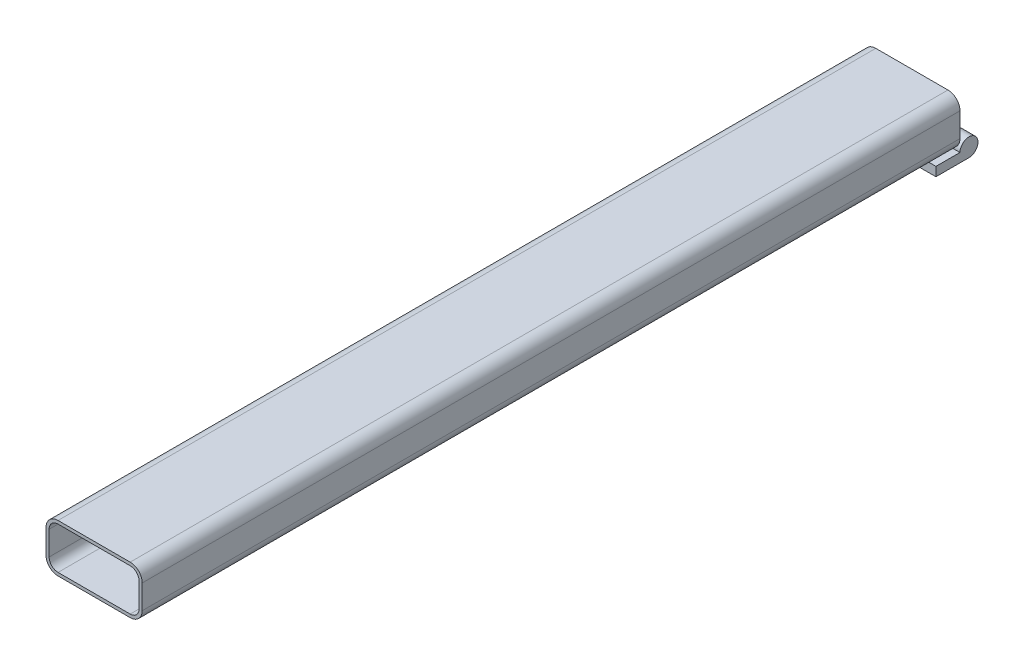
ISO-10303-21;
HEADER;
FILE_DESCRIPTION(('STEP AP214'),'2;1');
FILE_NAME('part.step','',(''),(''),'','','');
FILE_SCHEMA(('AUTOMOTIVE_DESIGN { 1 0 10303 214 1 1 1 1 }'));
ENDSEC;
DATA;
#1=APPLICATION_CONTEXT('core data for automotive mechanical design processes');
#2=APPLICATION_PROTOCOL_DEFINITION('international standard','automotive_design',2000,#1);
#3=PRODUCT_CONTEXT('',#1,'mechanical');
#4=PRODUCT('Part','Part','',(#3));
#5=PRODUCT_RELATED_PRODUCT_CATEGORY('part','',(#4));
#6=PRODUCT_DEFINITION_FORMATION('','',#4);
#7=PRODUCT_DEFINITION_CONTEXT('part definition',#1,'design');
#8=PRODUCT_DEFINITION('design','',#6,#7);
#9=PRODUCT_DEFINITION_SHAPE('','',#8);
#10=(LENGTH_UNIT() NAMED_UNIT(*) SI_UNIT(.MILLI.,.METRE.));
#11=(NAMED_UNIT(*) PLANE_ANGLE_UNIT() SI_UNIT($,.RADIAN.));
#12=(NAMED_UNIT(*) SI_UNIT($,.STERADIAN.) SOLID_ANGLE_UNIT());
#13=UNCERTAINTY_MEASURE_WITH_UNIT(LENGTH_MEASURE(1.E-05),#10,'distance_accuracy_value','');
#14=(GEOMETRIC_REPRESENTATION_CONTEXT(3) GLOBAL_UNCERTAINTY_ASSIGNED_CONTEXT((#13)) GLOBAL_UNIT_ASSIGNED_CONTEXT((#10,
#11,#12)) REPRESENTATION_CONTEXT('',''));
#15=CARTESIAN_POINT('',(0.,0.,0.));
#16=DIRECTION('',(0.,0.,1.));
#17=DIRECTION('',(1.,0.,0.));
#18=AXIS2_PLACEMENT_3D('',#15,#16,#17);
#19=CARTESIAN_POINT('',(-25.4,-12.7,-220.6625));
#20=DIRECTION('',(1.,0.,0.));
#21=DIRECTION('',(0.,0.,-1.));
#22=AXIS2_PLACEMENT_3D('',#19,#20,#21);
#23=CYLINDRICAL_SURFACE('',#22,4.7625);
#24=CARTESIAN_POINT('',(-9.525,-12.7,-220.6625));
#25=DIRECTION('',(-1.,0.,0.));
#26=DIRECTION('',(0.,0.,1.));
#27=AXIS2_PLACEMENT_3D('',#24,#25,#26);
#28=CIRCLE('',#27,4.7625);
#29=CARTESIAN_POINT('',(-9.52499999999999,-17.4625000000001,-220.6625));
#30=VERTEX_POINT('',#29);
#31=CARTESIAN_POINT('',(-9.525,-12.7,-215.9));
#32=VERTEX_POINT('',#31);
#33=EDGE_CURVE('E218',#30,#32,#28,.F.);
#34=ORIENTED_EDGE('',*,*,#33,.F.);
#35=DIRECTION('',(1.,0.,0.));
#36=VECTOR('',#35,1.);
#37=CARTESIAN_POINT('',(-25.4,-17.4625,-220.6625));
#38=LINE('',#37,#36);
#39=CARTESIAN_POINT('',(-25.4,-17.4625,-220.6625));
#40=VERTEX_POINT('',#39);
#41=EDGE_CURVE('E250',#40,#30,#38,.T.);
#42=ORIENTED_EDGE('',*,*,#41,.F.);
#43=CARTESIAN_POINT('',(-25.4,-12.7,-220.6625));
#44=DIRECTION('',(1.,0.,0.));
#45=DIRECTION('',(0.,0.,-1.));
#46=AXIS2_PLACEMENT_3D('',#43,#44,#45);
#47=CIRCLE('',#46,4.7625);
#48=CARTESIAN_POINT('',(-25.4,-12.7,-215.9));
#49=VERTEX_POINT('',#48);
#50=EDGE_CURVE('E231',#40,#49,#47,.T.);
#51=ORIENTED_EDGE('',*,*,#50,.T.);
#52=DIRECTION('',(1.,0.,0.));
#53=VECTOR('',#52,1.);
#54=CARTESIAN_POINT('',(-25.4,-12.7,-215.9));
#55=LINE('',#54,#53);
#56=CARTESIAN_POINT('',(-19.05,-12.7,-215.9));
#57=VERTEX_POINT('',#56);
#58=EDGE_CURVE('E245',#49,#57,#55,.T.);
#59=ORIENTED_EDGE('',*,*,#58,.T.);
#60=DIRECTION('',(1.,0.,0.));
#61=VECTOR('',#60,1.);
#62=CARTESIAN_POINT('',(-19.05,-12.7,-215.9));
#63=LINE('',#62,#61);
#64=EDGE_CURVE('E338',#57,#32,#63,.T.);
#65=ORIENTED_EDGE('',*,*,#64,.T.);
#66=EDGE_LOOP('',(#34,#42,#51,#59,#65));
#67=FACE_BOUND('',#66,.T.);
#68=ADVANCED_FACE('F32',(#67),#23,.T.);
#69=CARTESIAN_POINT('',(-19.05,-6.35,215.9));
#70=DIRECTION('',(0.,0.,-1.));
#71=DIRECTION('',(-1.,0.,0.));
#72=AXIS2_PLACEMENT_3D('',#69,#70,#71);
#73=PLANE('',#72);
#74=CARTESIAN_POINT('',(-19.05,-6.35,215.9));
#75=DIRECTION('',(0.,0.,1.));
#76=DIRECTION('',(-1.,0.,0.));
#77=AXIS2_PLACEMENT_3D('',#74,#75,#76);
#78=CIRCLE('',#77,6.35);
#79=CARTESIAN_POINT('',(-25.4,-6.35,215.9));
#80=VERTEX_POINT('',#79);
#81=CARTESIAN_POINT('',(-19.05,-12.7,215.9));
#82=VERTEX_POINT('',#81);
#83=EDGE_CURVE('E317',#80,#82,#78,.T.);
#84=ORIENTED_EDGE('',*,*,#83,.T.);
#85=DIRECTION('',(1.,0.,0.));
#86=VECTOR('',#85,1.);
#87=CARTESIAN_POINT('',(-19.05,-12.7,215.9));
#88=LINE('',#87,#86);
#89=CARTESIAN_POINT('',(19.05,-12.7,215.9));
#90=VERTEX_POINT('',#89);
#91=EDGE_CURVE('E320',#82,#90,#88,.T.);
#92=ORIENTED_EDGE('',*,*,#91,.T.);
#93=CARTESIAN_POINT('',(19.05,-6.35,215.9));
#94=DIRECTION('',(0.,0.,1.));
#95=DIRECTION('',(1.,0.,0.));
#96=AXIS2_PLACEMENT_3D('',#93,#94,#95);
#97=CIRCLE('',#96,6.35);
#98=CARTESIAN_POINT('',(25.4,-6.35,215.9));
#99=VERTEX_POINT('',#98);
#100=EDGE_CURVE('E323',#90,#99,#97,.T.);
#101=ORIENTED_EDGE('',*,*,#100,.T.);
#102=DIRECTION('',(0.,1.,0.));
#103=VECTOR('',#102,1.);
#104=CARTESIAN_POINT('',(25.4,-6.35,215.9));
#105=LINE('',#104,#103);
#106=CARTESIAN_POINT('',(25.4,6.35,215.9));
#107=VERTEX_POINT('',#106);
#108=EDGE_CURVE('E325',#99,#107,#105,.T.);
#109=ORIENTED_EDGE('',*,*,#108,.T.);
#110=CARTESIAN_POINT('',(19.05,6.35,215.9));
#111=DIRECTION('',(0.,0.,1.));
#112=DIRECTION('',(-1.,0.,0.));
#113=AXIS2_PLACEMENT_3D('',#110,#111,#112);
#114=CIRCLE('',#113,6.35);
#115=CARTESIAN_POINT('',(19.05,12.7,215.9));
#116=VERTEX_POINT('',#115);
#117=EDGE_CURVE('E327',#107,#116,#114,.T.);
#118=ORIENTED_EDGE('',*,*,#117,.T.);
#119=DIRECTION('',(-1.,0.,0.));
#120=VECTOR('',#119,1.);
#121=CARTESIAN_POINT('',(-19.05,12.7,215.9));
#122=LINE('',#121,#120);
#123=CARTESIAN_POINT('',(-19.05,12.7,215.9));
#124=VERTEX_POINT('',#123);
#125=EDGE_CURVE('E329',#116,#124,#122,.T.);
#126=ORIENTED_EDGE('',*,*,#125,.T.);
#127=CARTESIAN_POINT('',(-19.05,6.35,215.9));
#128=DIRECTION('',(0.,0.,1.));
#129=DIRECTION('',(-1.,0.,0.));
#130=AXIS2_PLACEMENT_3D('',#127,#128,#129);
#131=CIRCLE('',#130,6.35);
#132=CARTESIAN_POINT('',(-25.4,6.35,215.9));
#133=VERTEX_POINT('',#132);
#134=EDGE_CURVE('E331',#124,#133,#131,.T.);
#135=ORIENTED_EDGE('',*,*,#134,.T.);
#136=DIRECTION('',(0.,-1.,0.));
#137=VECTOR('',#136,1.);
#138=CARTESIAN_POINT('',(-25.4,-6.35,215.9));
#139=LINE('',#138,#137);
#140=EDGE_CURVE('E333',#133,#80,#139,.T.);
#141=ORIENTED_EDGE('',*,*,#140,.T.);
#142=EDGE_LOOP('',(#84,#92,#101,#109,#118,#126,#135,#141));
#143=FACE_BOUND('',#142,.T.);
#144=CARTESIAN_POINT('',(-19.05,6.35,215.9));
#145=DIRECTION('',(0.,0.,1.));
#146=DIRECTION('',(-1.,0.,0.));
#147=AXIS2_PLACEMENT_3D('',#144,#145,#146);
#148=CIRCLE('',#147,4.699);
#149=CARTESIAN_POINT('',(-19.05,11.049,215.9));
#150=VERTEX_POINT('',#149);
#151=CARTESIAN_POINT('',(-23.749,6.35,215.9));
#152=VERTEX_POINT('',#151);
#153=EDGE_CURVE('E261',#150,#152,#148,.T.);
#154=ORIENTED_EDGE('',*,*,#153,.F.);
#155=DIRECTION('',(-1.,0.,0.));
#156=VECTOR('',#155,1.);
#157=CARTESIAN_POINT('',(-19.05,11.049,215.9));
#158=LINE('',#157,#156);
#159=CARTESIAN_POINT('',(19.05,11.049,215.9));
#160=VERTEX_POINT('',#159);
#161=EDGE_CURVE('E276',#160,#150,#158,.T.);
#162=ORIENTED_EDGE('',*,*,#161,.F.);
#163=CARTESIAN_POINT('',(19.05,6.35,215.9));
#164=DIRECTION('',(0.,0.,1.));
#165=DIRECTION('',(-1.,0.,0.));
#166=AXIS2_PLACEMENT_3D('',#163,#164,#165);
#167=CIRCLE('',#166,4.699);
#168=CARTESIAN_POINT('',(23.749,6.35,215.9));
#169=VERTEX_POINT('',#168);
#170=EDGE_CURVE('E274',#169,#160,#167,.T.);
#171=ORIENTED_EDGE('',*,*,#170,.F.);
#172=DIRECTION('',(0.,1.,0.));
#173=VECTOR('',#172,1.);
#174=CARTESIAN_POINT('',(23.749,-6.35,215.9));
#175=LINE('',#174,#173);
#176=CARTESIAN_POINT('',(23.749,-6.35,215.9));
#177=VERTEX_POINT('',#176);
#178=EDGE_CURVE('E272',#177,#169,#175,.T.);
#179=ORIENTED_EDGE('',*,*,#178,.F.);
#180=CARTESIAN_POINT('',(19.05,-6.35,215.9));
#181=DIRECTION('',(0.,0.,1.));
#182=DIRECTION('',(1.,0.,0.));
#183=AXIS2_PLACEMENT_3D('',#180,#181,#182);
#184=CIRCLE('',#183,4.699);
#185=CARTESIAN_POINT('',(19.05,-11.049,215.9));
#186=VERTEX_POINT('',#185);
#187=EDGE_CURVE('E270',#186,#177,#184,.T.);
#188=ORIENTED_EDGE('',*,*,#187,.F.);
#189=DIRECTION('',(1.,0.,0.));
#190=VECTOR('',#189,1.);
#191=CARTESIAN_POINT('',(-19.05,-11.049,215.9));
#192=LINE('',#191,#190);
#193=CARTESIAN_POINT('',(-19.05,-11.049,215.9));
#194=VERTEX_POINT('',#193);
#195=EDGE_CURVE('E268',#194,#186,#192,.T.);
#196=ORIENTED_EDGE('',*,*,#195,.F.);
#197=CARTESIAN_POINT('',(-19.05,-6.35,215.9));
#198=DIRECTION('',(0.,0.,1.));
#199=DIRECTION('',(-1.,0.,0.));
#200=AXIS2_PLACEMENT_3D('',#197,#198,#199);
#201=CIRCLE('',#200,4.699);
#202=CARTESIAN_POINT('',(-23.749,-6.35,215.9));
#203=VERTEX_POINT('',#202);
#204=EDGE_CURVE('E266',#203,#194,#201,.T.);
#205=ORIENTED_EDGE('',*,*,#204,.F.);
#206=DIRECTION('',(0.,-1.,0.));
#207=VECTOR('',#206,1.);
#208=CARTESIAN_POINT('',(-23.749,-6.35,215.9));
#209=LINE('',#208,#207);
#210=EDGE_CURVE('E263',#152,#203,#209,.T.);
#211=ORIENTED_EDGE('',*,*,#210,.F.);
#212=EDGE_LOOP('',(#154,#162,#171,#179,#188,#196,#205,#211));
#213=FACE_BOUND('',#212,.T.);
#214=ADVANCED_FACE('F429',(#143,#213),#73,.F.);
#215=CARTESIAN_POINT('',(-19.05,-6.35,-215.9));
#216=DIRECTION('',(0.,0.,-1.));
#217=DIRECTION('',(-1.,0.,0.));
#218=AXIS2_PLACEMENT_3D('',#215,#216,#217);
#219=PLANE('',#218);
#220=DIRECTION('',(1.,0.,0.));
#221=VECTOR('',#220,1.);
#222=CARTESIAN_POINT('',(-19.05,-11.049,-215.9));
#223=LINE('',#222,#221);
#224=CARTESIAN_POINT('',(-19.05,-11.049,-215.9));
#225=VERTEX_POINT('',#224);
#226=CARTESIAN_POINT('',(19.05,-11.049,-215.9));
#227=VERTEX_POINT('',#226);
#228=EDGE_CURVE('E287',#225,#227,#223,.T.);
#229=ORIENTED_EDGE('',*,*,#228,.T.);
#230=CARTESIAN_POINT('',(19.05,-6.35,-215.9));
#231=DIRECTION('',(0.,0.,1.));
#232=DIRECTION('',(1.,0.,0.));
#233=AXIS2_PLACEMENT_3D('',#230,#231,#232);
#234=CIRCLE('',#233,4.699);
#235=CARTESIAN_POINT('',(23.749,-6.35,-215.9));
#236=VERTEX_POINT('',#235);
#237=EDGE_CURVE('E289',#227,#236,#234,.T.);
#238=ORIENTED_EDGE('',*,*,#237,.T.);
#239=DIRECTION('',(0.,1.,0.));
#240=VECTOR('',#239,1.);
#241=CARTESIAN_POINT('',(23.749,-6.35,-215.9));
#242=LINE('',#241,#240);
#243=CARTESIAN_POINT('',(23.749,6.35,-215.9));
#244=VERTEX_POINT('',#243);
#245=EDGE_CURVE('E292',#236,#244,#242,.T.);
#246=ORIENTED_EDGE('',*,*,#245,.T.);
#247=CARTESIAN_POINT('',(19.05,6.35,-215.9));
#248=DIRECTION('',(0.,0.,1.));
#249=DIRECTION('',(-1.,0.,0.));
#250=AXIS2_PLACEMENT_3D('',#247,#248,#249);
#251=CIRCLE('',#250,4.699);
#252=CARTESIAN_POINT('',(19.05,11.049,-215.9));
#253=VERTEX_POINT('',#252);
#254=EDGE_CURVE('E295',#244,#253,#251,.T.);
#255=ORIENTED_EDGE('',*,*,#254,.T.);
#256=DIRECTION('',(-1.,0.,0.));
#257=VECTOR('',#256,1.);
#258=CARTESIAN_POINT('',(-19.05,11.049,-215.9));
#259=LINE('',#258,#257);
#260=CARTESIAN_POINT('',(-19.05,11.049,-215.9));
#261=VERTEX_POINT('',#260);
#262=EDGE_CURVE('E264',#253,#261,#259,.T.);
#263=ORIENTED_EDGE('',*,*,#262,.T.);
#264=CARTESIAN_POINT('',(-19.05,6.35,-215.9));
#265=DIRECTION('',(0.,0.,1.));
#266=DIRECTION('',(-1.,0.,0.));
#267=AXIS2_PLACEMENT_3D('',#264,#265,#266);
#268=CIRCLE('',#267,4.699);
#269=CARTESIAN_POINT('',(-23.749,6.35,-215.9));
#270=VERTEX_POINT('',#269);
#271=EDGE_CURVE('E260',#261,#270,#268,.T.);
#272=ORIENTED_EDGE('',*,*,#271,.T.);
#273=DIRECTION('',(0.,-1.,0.));
#274=VECTOR('',#273,1.);
#275=CARTESIAN_POINT('',(-23.749,-6.35,-215.9));
#276=LINE('',#275,#274);
#277=CARTESIAN_POINT('',(-23.749,-6.35,-215.9));
#278=VERTEX_POINT('',#277);
#279=EDGE_CURVE('E281',#270,#278,#276,.T.);
#280=ORIENTED_EDGE('',*,*,#279,.T.);
#281=CARTESIAN_POINT('',(-19.05,-6.35,-215.9));
#282=DIRECTION('',(0.,0.,1.));
#283=DIRECTION('',(-1.,0.,0.));
#284=AXIS2_PLACEMENT_3D('',#281,#282,#283);
#285=CIRCLE('',#284,4.699);
#286=EDGE_CURVE('E284',#278,#225,#285,.T.);
#287=ORIENTED_EDGE('',*,*,#286,.T.);
#288=EDGE_LOOP('',(#229,#238,#246,#255,#263,#272,#280,#287));
#289=FACE_BOUND('',#288,.T.);
#290=DIRECTION('',(0.,-1.,0.));
#291=VECTOR('',#290,1.);
#292=CARTESIAN_POINT('',(-9.525,12.7,-215.9));
#293=LINE('',#292,#291);
#294=CARTESIAN_POINT('',(-9.525,-17.4625000000001,-215.9));
#295=VERTEX_POINT('',#294);
#296=EDGE_CURVE('E203',#32,#295,#293,.T.);
#297=ORIENTED_EDGE('',*,*,#296,.F.);
#298=ORIENTED_EDGE('',*,*,#64,.F.);
#299=CARTESIAN_POINT('',(-19.05,-6.35,-215.9));
#300=DIRECTION('',(0.,0.,1.));
#301=DIRECTION('',(-1.,0.,0.));
#302=AXIS2_PLACEMENT_3D('',#299,#300,#301);
#303=CIRCLE('',#302,6.35);
#304=CARTESIAN_POINT('',(-25.4,-6.35,-215.9));
#305=VERTEX_POINT('',#304);
#306=EDGE_CURVE('E316',#305,#57,#303,.T.);
#307=ORIENTED_EDGE('',*,*,#306,.F.);
#308=DIRECTION('',(0.,-1.,0.));
#309=VECTOR('',#308,1.);
#310=CARTESIAN_POINT('',(-25.4,-6.35,-215.9));
#311=LINE('',#310,#309);
#312=CARTESIAN_POINT('',(-25.4,6.35,-215.9));
#313=VERTEX_POINT('',#312);
#314=EDGE_CURVE('E321',#313,#305,#311,.T.);
#315=ORIENTED_EDGE('',*,*,#314,.F.);
#316=CARTESIAN_POINT('',(-19.05,6.35,-215.9));
#317=DIRECTION('',(0.,0.,1.));
#318=DIRECTION('',(-1.,0.,0.));
#319=AXIS2_PLACEMENT_3D('',#316,#317,#318);
#320=CIRCLE('',#319,6.35);
#321=CARTESIAN_POINT('',(-19.05,12.7,-215.9));
#322=VERTEX_POINT('',#321);
#323=EDGE_CURVE('E349',#322,#313,#320,.T.);
#324=ORIENTED_EDGE('',*,*,#323,.F.);
#325=DIRECTION('',(-1.,0.,0.));
#326=VECTOR('',#325,1.);
#327=CARTESIAN_POINT('',(-19.05,12.7,-215.9));
#328=LINE('',#327,#326);
#329=CARTESIAN_POINT('',(19.05,12.7,-215.9));
#330=VERTEX_POINT('',#329);
#331=EDGE_CURVE('E347',#330,#322,#328,.T.);
#332=ORIENTED_EDGE('',*,*,#331,.F.);
#333=CARTESIAN_POINT('',(19.05,6.35,-215.9));
#334=DIRECTION('',(0.,0.,1.));
#335=DIRECTION('',(-1.,0.,0.));
#336=AXIS2_PLACEMENT_3D('',#333,#334,#335);
#337=CIRCLE('',#336,6.35);
#338=CARTESIAN_POINT('',(25.4,6.35,-215.9));
#339=VERTEX_POINT('',#338);
#340=EDGE_CURVE('E345',#339,#330,#337,.T.);
#341=ORIENTED_EDGE('',*,*,#340,.F.);
#342=DIRECTION('',(0.,1.,0.));
#343=VECTOR('',#342,1.);
#344=CARTESIAN_POINT('',(25.4,-6.35,-215.9));
#345=LINE('',#344,#343);
#346=CARTESIAN_POINT('',(25.4,-6.35,-215.9));
#347=VERTEX_POINT('',#346);
#348=EDGE_CURVE('E343',#347,#339,#345,.T.);
#349=ORIENTED_EDGE('',*,*,#348,.F.);
#350=CARTESIAN_POINT('',(19.05,-6.35,-215.9));
#351=DIRECTION('',(0.,0.,1.));
#352=DIRECTION('',(1.,0.,0.));
#353=AXIS2_PLACEMENT_3D('',#350,#351,#352);
#354=CIRCLE('',#353,6.35);
#355=CARTESIAN_POINT('',(19.05,-12.7,-215.9));
#356=VERTEX_POINT('',#355);
#357=EDGE_CURVE('E341',#356,#347,#354,.T.);
#358=ORIENTED_EDGE('',*,*,#357,.F.);
#359=CARTESIAN_POINT('',(9.525,-12.7,-215.9));
#360=VERTEX_POINT('',#359);
#361=EDGE_CURVE('E202',#360,#356,#63,.T.);
#362=ORIENTED_EDGE('',*,*,#361,.F.);
#363=DIRECTION('',(0.,-1.,0.));
#364=VECTOR('',#363,1.);
#365=CARTESIAN_POINT('',(9.52500000000001,12.7,-215.9));
#366=LINE('',#365,#364);
#367=CARTESIAN_POINT('',(9.52500000000001,-17.4625000000001,-215.9));
#368=VERTEX_POINT('',#367);
#369=EDGE_CURVE('E195',#360,#368,#366,.T.);
#370=ORIENTED_EDGE('',*,*,#369,.T.);
#371=DIRECTION('',(-1.,0.,0.));
#372=VECTOR('',#371,1.);
#373=CARTESIAN_POINT('',(-9.525,-17.4625000000001,-215.9));
#374=LINE('',#373,#372);
#375=EDGE_CURVE('E199',#368,#295,#374,.T.);
#376=ORIENTED_EDGE('',*,*,#375,.T.);
#377=EDGE_LOOP('',(#297,#298,#307,#315,#324,#332,#341,#349,#358,#362,#370,#376));
#378=FACE_BOUND('',#377,.T.);
#379=ADVANCED_FACE('F197',(#289,#378),#219,.T.);
#380=CARTESIAN_POINT('',(-19.05,-6.35,215.9));
#381=DIRECTION('',(0.,0.,-1.));
#382=DIRECTION('',(-1.,0.,0.));
#383=AXIS2_PLACEMENT_3D('',#380,#381,#382);
#384=CYLINDRICAL_SURFACE('',#383,6.35);
#385=ORIENTED_EDGE('',*,*,#306,.T.);
#386=DIRECTION('',(0.,0.,-1.));
#387=VECTOR('',#386,1.);
#388=CARTESIAN_POINT('',(-19.05,-12.7,215.9));
#389=LINE('',#388,#387);
#390=CARTESIAN_POINT('',(-19.05,-12.7,-203.2));
#391=VERTEX_POINT('',#390);
#392=EDGE_CURVE('E248',#391,#57,#389,.T.);
#393=ORIENTED_EDGE('',*,*,#392,.F.);
#394=DIRECTION('',(0.,0.,-1.));
#395=VECTOR('',#394,1.);
#396=CARTESIAN_POINT('',(-19.05,-12.7,215.9));
#397=LINE('',#396,#395);
#398=EDGE_CURVE('E210',#82,#391,#397,.T.);
#399=ORIENTED_EDGE('',*,*,#398,.F.);
#400=ORIENTED_EDGE('',*,*,#83,.F.);
#401=DIRECTION('',(0.,0.,-1.));
#402=VECTOR('',#401,1.);
#403=CARTESIAN_POINT('',(-25.4,-6.35,215.9));
#404=LINE('',#403,#402);
#405=EDGE_CURVE('E335',#80,#305,#404,.T.);
#406=ORIENTED_EDGE('',*,*,#405,.T.);
#407=EDGE_LOOP('',(#385,#393,#399,#400,#406));
#408=FACE_BOUND('',#407,.T.);
#409=ADVANCED_FACE('F34',(#408),#384,.T.);
#410=CARTESIAN_POINT('',(-19.05,-12.7,215.9));
#411=DIRECTION('',(0.,1.,0.));
#412=DIRECTION('',(0.,0.,1.));
#413=AXIS2_PLACEMENT_3D('',#410,#411,#412);
#414=PLANE('',#413);
#415=ORIENTED_EDGE('',*,*,#398,.T.);
#416=DIRECTION('',(1.,0.,0.));
#417=VECTOR('',#416,1.);
#418=CARTESIAN_POINT('',(-25.4,-12.7,-203.2));
#419=LINE('',#418,#417);
#420=CARTESIAN_POINT('',(19.05,-12.7,-203.2));
#421=VERTEX_POINT('',#420);
#422=EDGE_CURVE('E258',#391,#421,#419,.T.);
#423=ORIENTED_EDGE('',*,*,#422,.T.);
#424=DIRECTION('',(0.,0.,-1.));
#425=VECTOR('',#424,1.);
#426=CARTESIAN_POINT('',(19.05,-12.7,215.9));
#427=LINE('',#426,#425);
#428=EDGE_CURVE('E370',#90,#421,#427,.T.);
#429=ORIENTED_EDGE('',*,*,#428,.F.);
#430=ORIENTED_EDGE('',*,*,#91,.F.);
#431=EDGE_LOOP('',(#415,#423,#429,#430));
#432=FACE_BOUND('',#431,.T.);
#433=ADVANCED_FACE('F377',(#432),#414,.F.);
#434=CARTESIAN_POINT('',(19.05,-6.35,215.9));
#435=DIRECTION('',(0.,0.,-1.));
#436=DIRECTION('',(-1.,0.,0.));
#437=AXIS2_PLACEMENT_3D('',#434,#435,#436);
#438=CYLINDRICAL_SURFACE('',#437,6.35);
#439=ORIENTED_EDGE('',*,*,#357,.T.);
#440=DIRECTION('',(0.,0.,-1.));
#441=VECTOR('',#440,1.);
#442=CARTESIAN_POINT('',(25.4,-6.35,215.9));
#443=LINE('',#442,#441);
#444=EDGE_CURVE('E366',#99,#347,#443,.T.);
#445=ORIENTED_EDGE('',*,*,#444,.F.);
#446=ORIENTED_EDGE('',*,*,#100,.F.);
#447=ORIENTED_EDGE('',*,*,#428,.T.);
#448=EDGE_CURVE('E369',#421,#356,#427,.T.);
#449=ORIENTED_EDGE('',*,*,#448,.T.);
#450=EDGE_LOOP('',(#439,#445,#446,#447,#449));
#451=FACE_BOUND('',#450,.T.);
#452=ADVANCED_FACE('F413',(#451),#438,.T.);
#453=CARTESIAN_POINT('',(25.4,-6.35,215.9));
#454=DIRECTION('',(-1.,0.,0.));
#455=DIRECTION('',(0.,0.,1.));
#456=AXIS2_PLACEMENT_3D('',#453,#454,#455);
#457=PLANE('',#456);
#458=ORIENTED_EDGE('',*,*,#348,.T.);
#459=DIRECTION('',(0.,0.,-1.));
#460=VECTOR('',#459,1.);
#461=CARTESIAN_POINT('',(25.4,6.35,215.9));
#462=LINE('',#461,#460);
#463=EDGE_CURVE('E363',#107,#339,#462,.T.);
#464=ORIENTED_EDGE('',*,*,#463,.F.);
#465=ORIENTED_EDGE('',*,*,#108,.F.);
#466=ORIENTED_EDGE('',*,*,#444,.T.);
#467=EDGE_LOOP('',(#458,#464,#465,#466));
#468=FACE_BOUND('',#467,.T.);
#469=ADVANCED_FACE('F421',(#468),#457,.F.);
#470=CARTESIAN_POINT('',(19.05,6.35,215.9));
#471=DIRECTION('',(0.,0.,-1.));
#472=DIRECTION('',(-1.,0.,0.));
#473=AXIS2_PLACEMENT_3D('',#470,#471,#472);
#474=CYLINDRICAL_SURFACE('',#473,6.35);
#475=ORIENTED_EDGE('',*,*,#340,.T.);
#476=DIRECTION('',(0.,0.,-1.));
#477=VECTOR('',#476,1.);
#478=CARTESIAN_POINT('',(19.05,12.7,215.9));
#479=LINE('',#478,#477);
#480=EDGE_CURVE('E360',#116,#330,#479,.T.);
#481=ORIENTED_EDGE('',*,*,#480,.F.);
#482=ORIENTED_EDGE('',*,*,#117,.F.);
#483=ORIENTED_EDGE('',*,*,#463,.T.);
#484=EDGE_LOOP('',(#475,#481,#482,#483));
#485=FACE_BOUND('',#484,.T.);
#486=ADVANCED_FACE('F425',(#485),#474,.T.);
#487=CARTESIAN_POINT('',(-19.05,12.7,215.9));
#488=DIRECTION('',(0.,-1.,0.));
#489=DIRECTION('',(0.,0.,-1.));
#490=AXIS2_PLACEMENT_3D('',#487,#488,#489);
#491=PLANE('',#490);
#492=ORIENTED_EDGE('',*,*,#331,.T.);
#493=DIRECTION('',(0.,0.,-1.));
#494=VECTOR('',#493,1.);
#495=CARTESIAN_POINT('',(-19.05,12.7,215.9));
#496=LINE('',#495,#494);
#497=EDGE_CURVE('E357',#124,#322,#496,.T.);
#498=ORIENTED_EDGE('',*,*,#497,.F.);
#499=ORIENTED_EDGE('',*,*,#125,.F.);
#500=ORIENTED_EDGE('',*,*,#480,.T.);
#501=EDGE_LOOP('',(#492,#498,#499,#500));
#502=FACE_BOUND('',#501,.T.);
#503=ADVANCED_FACE('F442',(#502),#491,.F.);
#504=CARTESIAN_POINT('',(-19.05,6.35,215.9));
#505=DIRECTION('',(0.,0.,-1.));
#506=DIRECTION('',(-1.,0.,0.));
#507=AXIS2_PLACEMENT_3D('',#504,#505,#506);
#508=CYLINDRICAL_SURFACE('',#507,6.35);
#509=ORIENTED_EDGE('',*,*,#323,.T.);
#510=DIRECTION('',(0.,0.,-1.));
#511=VECTOR('',#510,1.);
#512=CARTESIAN_POINT('',(-25.4,6.35,215.9));
#513=LINE('',#512,#511);
#514=EDGE_CURVE('E354',#133,#313,#513,.T.);
#515=ORIENTED_EDGE('',*,*,#514,.F.);
#516=ORIENTED_EDGE('',*,*,#134,.F.);
#517=ORIENTED_EDGE('',*,*,#497,.T.);
#518=EDGE_LOOP('',(#509,#515,#516,#517));
#519=FACE_BOUND('',#518,.T.);
#520=ADVANCED_FACE('F440',(#519),#508,.T.);
#521=CARTESIAN_POINT('',(-25.4,-6.35,215.9));
#522=DIRECTION('',(1.,0.,0.));
#523=DIRECTION('',(0.,0.,-1.));
#524=AXIS2_PLACEMENT_3D('',#521,#522,#523);
#525=PLANE('',#524);
#526=ORIENTED_EDGE('',*,*,#314,.T.);
#527=ORIENTED_EDGE('',*,*,#405,.F.);
#528=ORIENTED_EDGE('',*,*,#140,.F.);
#529=ORIENTED_EDGE('',*,*,#514,.T.);
#530=EDGE_LOOP('',(#526,#527,#528,#529));
#531=FACE_BOUND('',#530,.T.);
#532=ADVANCED_FACE('F437',(#531),#525,.F.);
#533=CARTESIAN_POINT('',(-19.05,6.35,215.9));
#534=DIRECTION('',(0.,0.,-1.));
#535=DIRECTION('',(-1.,0.,0.));
#536=AXIS2_PLACEMENT_3D('',#533,#534,#535);
#537=CYLINDRICAL_SURFACE('',#536,4.699);
#538=ORIENTED_EDGE('',*,*,#271,.F.);
#539=DIRECTION('',(0.,0.,-1.));
#540=VECTOR('',#539,1.);
#541=CARTESIAN_POINT('',(-19.05,11.049,215.9));
#542=LINE('',#541,#540);
#543=EDGE_CURVE('E278',#150,#261,#542,.T.);
#544=ORIENTED_EDGE('',*,*,#543,.F.);
#545=ORIENTED_EDGE('',*,*,#153,.T.);
#546=DIRECTION('',(0.,0.,-1.));
#547=VECTOR('',#546,1.);
#548=CARTESIAN_POINT('',(-23.749,6.35,215.9));
#549=LINE('',#548,#547);
#550=EDGE_CURVE('E313',#152,#270,#549,.T.);
#551=ORIENTED_EDGE('',*,*,#550,.T.);
#552=EDGE_LOOP('',(#538,#544,#545,#551));
#553=FACE_BOUND('',#552,.T.);
#554=ADVANCED_FACE('F496',(#553),#537,.F.);
#555=CARTESIAN_POINT('',(-23.749,-6.35,215.9));
#556=DIRECTION('',(1.,0.,0.));
#557=DIRECTION('',(0.,0.,-1.));
#558=AXIS2_PLACEMENT_3D('',#555,#556,#557);
#559=PLANE('',#558);
#560=ORIENTED_EDGE('',*,*,#279,.F.);
#561=ORIENTED_EDGE('',*,*,#550,.F.);
#562=ORIENTED_EDGE('',*,*,#210,.T.);
#563=DIRECTION('',(0.,0.,-1.));
#564=VECTOR('',#563,1.);
#565=CARTESIAN_POINT('',(-23.749,-6.35,215.9));
#566=LINE('',#565,#564);
#567=EDGE_CURVE('E311',#203,#278,#566,.T.);
#568=ORIENTED_EDGE('',*,*,#567,.T.);
#569=EDGE_LOOP('',(#560,#561,#562,#568));
#570=FACE_BOUND('',#569,.T.);
#571=ADVANCED_FACE('F492',(#570),#559,.T.);
#572=CARTESIAN_POINT('',(-19.05,-6.35,215.9));
#573=DIRECTION('',(0.,0.,-1.));
#574=DIRECTION('',(-1.,0.,0.));
#575=AXIS2_PLACEMENT_3D('',#572,#573,#574);
#576=CYLINDRICAL_SURFACE('',#575,4.699);
#577=ORIENTED_EDGE('',*,*,#286,.F.);
#578=ORIENTED_EDGE('',*,*,#567,.F.);
#579=ORIENTED_EDGE('',*,*,#204,.T.);
#580=DIRECTION('',(0.,0.,-1.));
#581=VECTOR('',#580,1.);
#582=CARTESIAN_POINT('',(-19.05,-11.049,215.9));
#583=LINE('',#582,#581);
#584=EDGE_CURVE('E309',#194,#225,#583,.T.);
#585=ORIENTED_EDGE('',*,*,#584,.T.);
#586=EDGE_LOOP('',(#577,#578,#579,#585));
#587=FACE_BOUND('',#586,.T.);
#588=ADVANCED_FACE('F488',(#587),#576,.F.);
#589=CARTESIAN_POINT('',(-19.05,-11.049,215.9));
#590=DIRECTION('',(0.,1.,0.));
#591=DIRECTION('',(0.,0.,1.));
#592=AXIS2_PLACEMENT_3D('',#589,#590,#591);
#593=PLANE('',#592);
#594=ORIENTED_EDGE('',*,*,#228,.F.);
#595=ORIENTED_EDGE('',*,*,#584,.F.);
#596=ORIENTED_EDGE('',*,*,#195,.T.);
#597=DIRECTION('',(0.,0.,-1.));
#598=VECTOR('',#597,1.);
#599=CARTESIAN_POINT('',(19.05,-11.049,215.9));
#600=LINE('',#599,#598);
#601=EDGE_CURVE('E306',#186,#227,#600,.T.);
#602=ORIENTED_EDGE('',*,*,#601,.T.);
#603=EDGE_LOOP('',(#594,#595,#596,#602));
#604=FACE_BOUND('',#603,.T.);
#605=ADVANCED_FACE('F484',(#604),#593,.T.);
#606=CARTESIAN_POINT('',(19.05,-6.35,215.9));
#607=DIRECTION('',(0.,0.,-1.));
#608=DIRECTION('',(-1.,0.,0.));
#609=AXIS2_PLACEMENT_3D('',#606,#607,#608);
#610=CYLINDRICAL_SURFACE('',#609,4.699);
#611=ORIENTED_EDGE('',*,*,#237,.F.);
#612=ORIENTED_EDGE('',*,*,#601,.F.);
#613=ORIENTED_EDGE('',*,*,#187,.T.);
#614=DIRECTION('',(0.,0.,-1.));
#615=VECTOR('',#614,1.);
#616=CARTESIAN_POINT('',(23.749,-6.35,215.9));
#617=LINE('',#616,#615);
#618=EDGE_CURVE('E304',#177,#236,#617,.T.);
#619=ORIENTED_EDGE('',*,*,#618,.T.);
#620=EDGE_LOOP('',(#611,#612,#613,#619));
#621=FACE_BOUND('',#620,.T.);
#622=ADVANCED_FACE('F480',(#621),#610,.F.);
#623=CARTESIAN_POINT('',(23.749,-6.35,215.9));
#624=DIRECTION('',(-1.,0.,0.));
#625=DIRECTION('',(0.,-1.,0.));
#626=AXIS2_PLACEMENT_3D('',#623,#624,#625);
#627=PLANE('',#626);
#628=ORIENTED_EDGE('',*,*,#245,.F.);
#629=ORIENTED_EDGE('',*,*,#618,.F.);
#630=ORIENTED_EDGE('',*,*,#178,.T.);
#631=DIRECTION('',(0.,0.,-1.));
#632=VECTOR('',#631,1.);
#633=CARTESIAN_POINT('',(23.749,6.35,215.9));
#634=LINE('',#633,#632);
#635=EDGE_CURVE('E302',#169,#244,#634,.T.);
#636=ORIENTED_EDGE('',*,*,#635,.T.);
#637=EDGE_LOOP('',(#628,#629,#630,#636));
#638=FACE_BOUND('',#637,.T.);
#639=ADVANCED_FACE('F476',(#638),#627,.T.);
#640=CARTESIAN_POINT('',(19.05,6.35,215.9));
#641=DIRECTION('',(0.,0.,-1.));
#642=DIRECTION('',(-1.,0.,0.));
#643=AXIS2_PLACEMENT_3D('',#640,#641,#642);
#644=CYLINDRICAL_SURFACE('',#643,4.699);
#645=ORIENTED_EDGE('',*,*,#254,.F.);
#646=ORIENTED_EDGE('',*,*,#635,.F.);
#647=ORIENTED_EDGE('',*,*,#170,.T.);
#648=DIRECTION('',(0.,0.,-1.));
#649=VECTOR('',#648,1.);
#650=CARTESIAN_POINT('',(19.05,11.049,215.9));
#651=LINE('',#650,#649);
#652=EDGE_CURVE('E56',#160,#253,#651,.T.);
#653=ORIENTED_EDGE('',*,*,#652,.T.);
#654=EDGE_LOOP('',(#645,#646,#647,#653));
#655=FACE_BOUND('',#654,.T.);
#656=ADVANCED_FACE('F473',(#655),#644,.F.);
#657=CARTESIAN_POINT('',(-19.05,11.049,215.9));
#658=DIRECTION('',(0.,-1.,0.));
#659=DIRECTION('',(0.,0.,-1.));
#660=AXIS2_PLACEMENT_3D('',#657,#658,#659);
#661=PLANE('',#660);
#662=ORIENTED_EDGE('',*,*,#262,.F.);
#663=ORIENTED_EDGE('',*,*,#652,.F.);
#664=ORIENTED_EDGE('',*,*,#161,.T.);
#665=ORIENTED_EDGE('',*,*,#543,.T.);
#666=EDGE_LOOP('',(#662,#663,#664,#665));
#667=FACE_BOUND('',#666,.T.);
#668=ADVANCED_FACE('F468',(#667),#661,.T.);
#669=CARTESIAN_POINT('',(-25.4,-12.7,-215.9));
#670=DIRECTION('',(0.,1.,0.));
#671=DIRECTION('',(0.,0.,1.));
#672=AXIS2_PLACEMENT_3D('',#669,#670,#671);
#673=PLANE('',#672);
#674=ORIENTED_EDGE('',*,*,#448,.F.);
#675=CARTESIAN_POINT('',(25.4,-12.7,-203.2));
#676=VERTEX_POINT('',#675);
#677=EDGE_CURVE('E234',#421,#676,#419,.T.);
#678=ORIENTED_EDGE('',*,*,#677,.T.);
#679=DIRECTION('',(0.,0.,1.));
#680=VECTOR('',#679,1.);
#681=CARTESIAN_POINT('',(25.4,-12.7,-215.9));
#682=LINE('',#681,#680);
#683=CARTESIAN_POINT('',(25.4,-12.7,-215.9));
#684=VERTEX_POINT('',#683);
#685=EDGE_CURVE('E220',#684,#676,#682,.T.);
#686=ORIENTED_EDGE('',*,*,#685,.F.);
#687=EDGE_CURVE('E249',#356,#684,#55,.T.);
#688=ORIENTED_EDGE('',*,*,#687,.F.);
#689=EDGE_LOOP('',(#674,#678,#686,#688));
#690=FACE_BOUND('',#689,.T.);
#691=ADVANCED_FACE('F404',(#690),#673,.T.);
#692=CARTESIAN_POINT('',(-25.4,-12.7,-203.2));
#693=VERTEX_POINT('',#692);
#694=EDGE_CURVE('E255',#693,#391,#419,.T.);
#695=ORIENTED_EDGE('',*,*,#694,.T.);
#696=ORIENTED_EDGE('',*,*,#392,.T.);
#697=ORIENTED_EDGE('',*,*,#58,.F.);
#698=DIRECTION('',(0.,0.,1.));
#699=VECTOR('',#698,1.);
#700=CARTESIAN_POINT('',(-25.4,-12.7,-215.9));
#701=LINE('',#700,#699);
#702=EDGE_CURVE('E221',#49,#693,#701,.T.);
#703=ORIENTED_EDGE('',*,*,#702,.T.);
#704=EDGE_LOOP('',(#695,#696,#697,#703));
#705=FACE_BOUND('',#704,.T.);
#706=ADVANCED_FACE('F384',(#705),#673,.T.);
#707=CARTESIAN_POINT('',(9.525,-12.7,-220.6625));
#708=DIRECTION('',(1.,0.,0.));
#709=DIRECTION('',(0.,0.,-1.));
#710=AXIS2_PLACEMENT_3D('',#707,#708,#709);
#711=CIRCLE('',#710,4.7625);
#712=CARTESIAN_POINT('',(9.525,-17.4625,-220.6625));
#713=VERTEX_POINT('',#712);
#714=EDGE_CURVE('E48',#360,#713,#711,.F.);
#715=ORIENTED_EDGE('',*,*,#714,.F.);
#716=ORIENTED_EDGE('',*,*,#361,.T.);
#717=ORIENTED_EDGE('',*,*,#687,.T.);
#718=CARTESIAN_POINT('',(25.4,-12.7,-220.6625));
#719=DIRECTION('',(1.,0.,0.));
#720=DIRECTION('',(0.,0.,-1.));
#721=AXIS2_PLACEMENT_3D('',#718,#719,#720);
#722=CIRCLE('',#721,4.7625);
#723=CARTESIAN_POINT('',(25.4,-17.4625,-220.6625));
#724=VERTEX_POINT('',#723);
#725=EDGE_CURVE('E225',#724,#684,#722,.T.);
#726=ORIENTED_EDGE('',*,*,#725,.F.);
#727=EDGE_CURVE('E252',#713,#724,#38,.T.);
#728=ORIENTED_EDGE('',*,*,#727,.F.);
#729=EDGE_LOOP('',(#715,#716,#717,#726,#728));
#730=FACE_BOUND('',#729,.T.);
#731=ADVANCED_FACE('F411',(#730),#23,.T.);
#732=CARTESIAN_POINT('',(-25.4,-17.4625,-203.2));
#733=DIRECTION('',(0.,-1.,0.));
#734=DIRECTION('',(0.,0.,-1.));
#735=AXIS2_PLACEMENT_3D('',#732,#733,#734);
#736=PLANE('',#735);
#737=DIRECTION('',(0.,0.,-1.));
#738=VECTOR('',#737,1.);
#739=CARTESIAN_POINT('',(-9.52499999999999,-17.4625000000001,-225.425));
#740=LINE('',#739,#738);
#741=EDGE_CURVE('E204',#295,#30,#740,.T.);
#742=ORIENTED_EDGE('',*,*,#741,.F.);
#743=ORIENTED_EDGE('',*,*,#375,.F.);
#744=DIRECTION('',(0.,0.,1.));
#745=VECTOR('',#744,1.);
#746=CARTESIAN_POINT('',(9.525,-17.4625,-203.2));
#747=LINE('',#746,#745);
#748=EDGE_CURVE('E206',#713,#368,#747,.T.);
#749=ORIENTED_EDGE('',*,*,#748,.F.);
#750=ORIENTED_EDGE('',*,*,#727,.T.);
#751=DIRECTION('',(0.,0.,-1.));
#752=VECTOR('',#751,1.);
#753=CARTESIAN_POINT('',(25.4,-17.4625,-203.2));
#754=LINE('',#753,#752);
#755=CARTESIAN_POINT('',(25.4,-17.4625,-203.2));
#756=VERTEX_POINT('',#755);
#757=EDGE_CURVE('E240',#756,#724,#754,.T.);
#758=ORIENTED_EDGE('',*,*,#757,.F.);
#759=DIRECTION('',(1.,0.,0.));
#760=VECTOR('',#759,1.);
#761=CARTESIAN_POINT('',(-25.4,-17.4625,-203.2));
#762=LINE('',#761,#760);
#763=CARTESIAN_POINT('',(-25.4,-17.4625,-203.2));
#764=VERTEX_POINT('',#763);
#765=EDGE_CURVE('E253',#764,#756,#762,.T.);
#766=ORIENTED_EDGE('',*,*,#765,.F.);
#767=DIRECTION('',(0.,0.,-1.));
#768=VECTOR('',#767,1.);
#769=CARTESIAN_POINT('',(-25.4,-17.4625,-203.2));
#770=LINE('',#769,#768);
#771=EDGE_CURVE('E228',#764,#40,#770,.T.);
#772=ORIENTED_EDGE('',*,*,#771,.T.);
#773=ORIENTED_EDGE('',*,*,#41,.T.);
#774=EDGE_LOOP('',(#742,#743,#749,#750,#758,#766,#772,#773));
#775=FACE_BOUND('',#774,.T.);
#776=ADVANCED_FACE('F211',(#775),#736,.T.);
#777=CARTESIAN_POINT('',(-25.4,-12.7,-203.2));
#778=DIRECTION('',(0.,0.,1.));
#779=DIRECTION('',(1.,0.,0.));
#780=AXIS2_PLACEMENT_3D('',#777,#778,#779);
#781=PLANE('',#780);
#782=DIRECTION('',(0.,-1.,0.));
#783=VECTOR('',#782,1.);
#784=CARTESIAN_POINT('',(25.4,-12.7,-203.2));
#785=LINE('',#784,#783);
#786=EDGE_CURVE('E237',#676,#756,#785,.T.);
#787=ORIENTED_EDGE('',*,*,#786,.F.);
#788=ORIENTED_EDGE('',*,*,#677,.F.);
#789=ORIENTED_EDGE('',*,*,#422,.F.);
#790=ORIENTED_EDGE('',*,*,#694,.F.);
#791=DIRECTION('',(0.,-1.,0.));
#792=VECTOR('',#791,1.);
#793=CARTESIAN_POINT('',(-25.4,-12.7,-203.2));
#794=LINE('',#793,#792);
#795=EDGE_CURVE('E224',#693,#764,#794,.T.);
#796=ORIENTED_EDGE('',*,*,#795,.T.);
#797=ORIENTED_EDGE('',*,*,#765,.T.);
#798=EDGE_LOOP('',(#787,#788,#789,#790,#796,#797));
#799=FACE_BOUND('',#798,.T.);
#800=ADVANCED_FACE('F400',(#799),#781,.T.);
#801=CARTESIAN_POINT('',(-25.4,-12.7,-220.6625));
#802=DIRECTION('',(1.,0.,0.));
#803=DIRECTION('',(0.,0.,-1.));
#804=AXIS2_PLACEMENT_3D('',#801,#802,#803);
#805=PLANE('',#804);
#806=ORIENTED_EDGE('',*,*,#702,.F.);
#807=ORIENTED_EDGE('',*,*,#50,.F.);
#808=ORIENTED_EDGE('',*,*,#771,.F.);
#809=ORIENTED_EDGE('',*,*,#795,.F.);
#810=EDGE_LOOP('',(#806,#807,#808,#809));
#811=FACE_BOUND('',#810,.T.);
#812=ADVANCED_FACE('F397',(#811),#805,.F.);
#813=CARTESIAN_POINT('',(25.4,-12.7,-220.6625));
#814=DIRECTION('',(1.,0.,0.));
#815=DIRECTION('',(0.,0.,-1.));
#816=AXIS2_PLACEMENT_3D('',#813,#814,#815);
#817=PLANE('',#816);
#818=ORIENTED_EDGE('',*,*,#685,.T.);
#819=ORIENTED_EDGE('',*,*,#786,.T.);
#820=ORIENTED_EDGE('',*,*,#757,.T.);
#821=ORIENTED_EDGE('',*,*,#725,.T.);
#822=EDGE_LOOP('',(#818,#819,#820,#821));
#823=FACE_BOUND('',#822,.T.);
#824=ADVANCED_FACE('F408',(#823),#817,.T.);
#825=CARTESIAN_POINT('',(-9.52499999999999,12.7,-225.425));
#826=DIRECTION('',(-1.,0.,0.));
#827=DIRECTION('',(0.,0.,1.));
#828=AXIS2_PLACEMENT_3D('',#825,#826,#827);
#829=PLANE('',#828);
#830=CARTESIAN_POINT('',(-9.525,-12.7,-220.6625));
#831=DIRECTION('',(-1.,0.,0.));
#832=DIRECTION('',(0.,0.,1.));
#833=AXIS2_PLACEMENT_3D('',#830,#831,#832);
#834=CIRCLE('',#833,3.17499999999997);
#835=CARTESIAN_POINT('',(-9.525,-12.7,-217.4875));
#836=VERTEX_POINT('',#835);
#837=EDGE_CURVE('E11',#836,#836,#834,.F.);
#838=ORIENTED_EDGE('',*,*,#837,.F.);
#839=EDGE_LOOP('',(#838));
#840=FACE_BOUND('',#839,.T.);
#841=ORIENTED_EDGE('',*,*,#33,.T.);
#842=ORIENTED_EDGE('',*,*,#296,.T.);
#843=ORIENTED_EDGE('',*,*,#741,.T.);
#844=EDGE_LOOP('',(#841,#842,#843));
#845=FACE_BOUND('',#844,.T.);
#846=ADVANCED_FACE('F392',(#840,#845),#829,.F.);
#847=CARTESIAN_POINT('',(9.52500000000001,12.7,-215.9));
#848=DIRECTION('',(1.,0.,0.));
#849=DIRECTION('',(0.,0.,-1.));
#850=AXIS2_PLACEMENT_3D('',#847,#848,#849);
#851=PLANE('',#850);
#852=CARTESIAN_POINT('',(9.52500000000001,-12.7,-220.6625));
#853=DIRECTION('',(1.,0.,0.));
#854=DIRECTION('',(0.,0.,-1.));
#855=AXIS2_PLACEMENT_3D('',#852,#853,#854);
#856=CIRCLE('',#855,3.17499999999997);
#857=CARTESIAN_POINT('',(9.52500000000001,-12.7,-223.8375));
#858=VERTEX_POINT('',#857);
#859=EDGE_CURVE('E36',#858,#858,#856,.F.);
#860=ORIENTED_EDGE('',*,*,#859,.F.);
#861=EDGE_LOOP('',(#860));
#862=FACE_BOUND('',#861,.T.);
#863=ORIENTED_EDGE('',*,*,#714,.T.);
#864=ORIENTED_EDGE('',*,*,#748,.T.);
#865=ORIENTED_EDGE('',*,*,#369,.F.);
#866=EDGE_LOOP('',(#863,#864,#865));
#867=FACE_BOUND('',#866,.T.);
#868=ADVANCED_FACE('F207',(#862,#867),#851,.F.);
#869=CARTESIAN_POINT('',(19.05,-12.7,-220.6625));
#870=DIRECTION('',(-1.,0.,0.));
#871=DIRECTION('',(0.,0.,1.));
#872=AXIS2_PLACEMENT_3D('',#869,#870,#871);
#873=CYLINDRICAL_SURFACE('',#872,3.17499999999997);
#874=ORIENTED_EDGE('',*,*,#859,.T.);
#875=EDGE_LOOP('',(#874));
#876=FACE_BOUND('',#875,.T.);
#877=ORIENTED_EDGE('',*,*,#837,.T.);
#878=EDGE_LOOP('',(#877));
#879=FACE_BOUND('',#878,.T.);
#880=ADVANCED_FACE('F673',(#876,#879),#873,.T.);
#881=CLOSED_SHELL('',(#68,#214,#379,#409,#433,#452,#469,#486,#503,#520,#532,#554,#571,#588,#605,
#622,#639,#656,#668,#691,#706,#731,#776,#800,#812,#824,#846,#868,#880));
#882=MANIFOLD_SOLID_BREP('B2',#881);
#883=ADVANCED_BREP_SHAPE_REPRESENTATION('',(#18,#882),#14);
#884=SHAPE_DEFINITION_REPRESENTATION(#9,#883);
ENDSEC;
END-ISO-10303-21;
